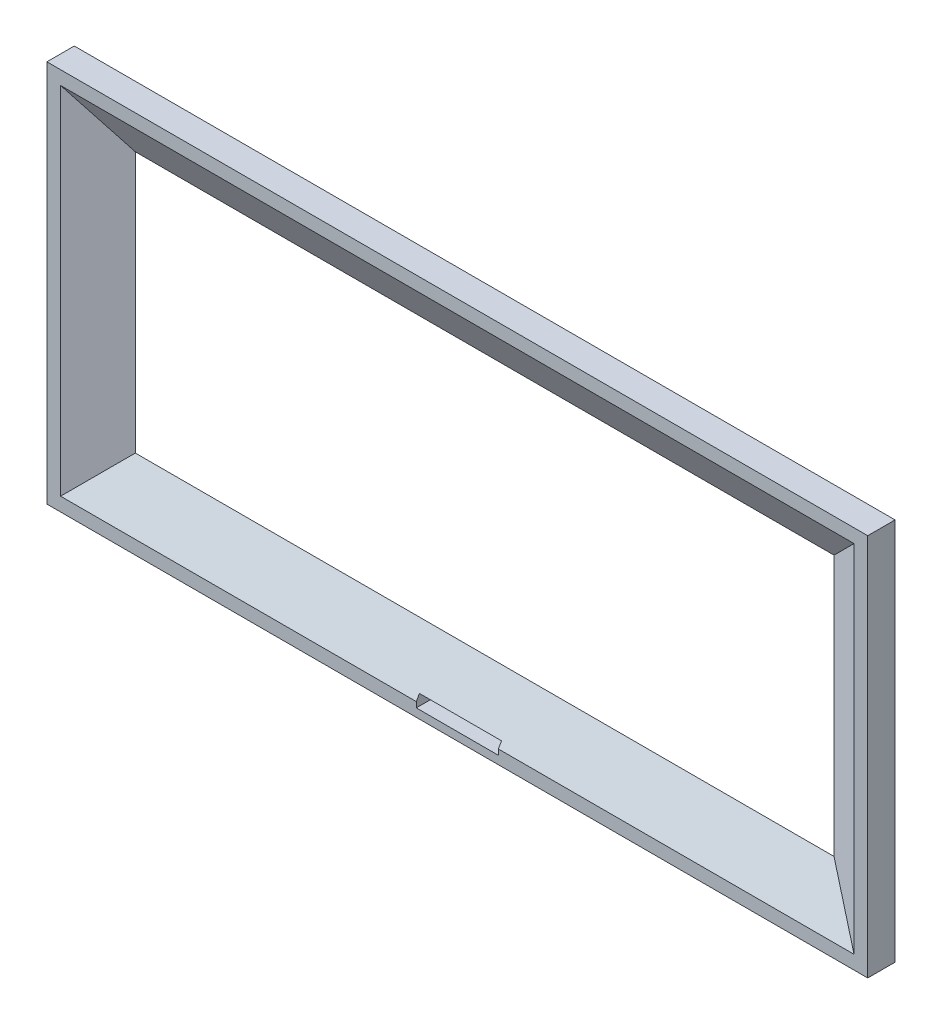
ISO-10303-21;
HEADER;
FILE_DESCRIPTION(('STEP AP214'),'2;1');
FILE_NAME('part.step','',(''),(''),'','','');
FILE_SCHEMA(('AUTOMOTIVE_DESIGN { 1 0 10303 214 1 1 1 1 }'));
ENDSEC;
DATA;
#1=APPLICATION_CONTEXT('core data for automotive mechanical design processes');
#2=APPLICATION_PROTOCOL_DEFINITION('international standard','automotive_design',2000,#1);
#3=PRODUCT_CONTEXT('',#1,'mechanical');
#4=PRODUCT('Part','Part','',(#3));
#5=PRODUCT_RELATED_PRODUCT_CATEGORY('part','',(#4));
#6=PRODUCT_DEFINITION_FORMATION('','',#4);
#7=PRODUCT_DEFINITION_CONTEXT('part definition',#1,'design');
#8=PRODUCT_DEFINITION('design','',#6,#7);
#9=PRODUCT_DEFINITION_SHAPE('','',#8);
#10=(LENGTH_UNIT() NAMED_UNIT(*) SI_UNIT(.MILLI.,.METRE.));
#11=(NAMED_UNIT(*) PLANE_ANGLE_UNIT() SI_UNIT($,.RADIAN.));
#12=(NAMED_UNIT(*) SI_UNIT($,.STERADIAN.) SOLID_ANGLE_UNIT());
#13=UNCERTAINTY_MEASURE_WITH_UNIT(LENGTH_MEASURE(1.E-05),#10,'distance_accuracy_value','');
#14=(GEOMETRIC_REPRESENTATION_CONTEXT(3) GLOBAL_UNCERTAINTY_ASSIGNED_CONTEXT((#13)) GLOBAL_UNIT_ASSIGNED_CONTEXT((#10,
#11,#12)) REPRESENTATION_CONTEXT('',''));
#15=CARTESIAN_POINT('',(0.,0.,0.));
#16=DIRECTION('',(0.,0.,1.));
#17=DIRECTION('',(1.,0.,0.));
#18=AXIS2_PLACEMENT_3D('',#15,#16,#17);
#19=CARTESIAN_POINT('',(0.,0.,10.));
#20=DIRECTION('',(0.,0.,-1.));
#21=DIRECTION('',(-1.,0.,0.));
#22=AXIS2_PLACEMENT_3D('',#19,#20,#21);
#23=PLANE('',#22);
#24=DIRECTION('',(1.,0.,0.));
#25=VECTOR('',#24,1.);
#26=CARTESIAN_POINT('',(140.,-22.,10.));
#27=LINE('',#26,#25);
#28=CARTESIAN_POINT('',(110.,-22.0000000000001,10.));
#29=VERTEX_POINT('',#28);
#30=CARTESIAN_POINT('',(140.,-22.,10.));
#31=VERTEX_POINT('',#30);
#32=EDGE_CURVE('E139',#29,#31,#27,.T.);
#33=ORIENTED_EDGE('',*,*,#32,.F.);
#34=DIRECTION('',(0.,-1.,0.));
#35=VECTOR('',#34,1.);
#36=CARTESIAN_POINT('',(110.,-22.0000000000001,10.));
#37=LINE('',#36,#35);
#38=CARTESIAN_POINT('',(110.,-20.0000000000001,10.));
#39=VERTEX_POINT('',#38);
#40=EDGE_CURVE('E146',#39,#29,#37,.T.);
#41=ORIENTED_EDGE('',*,*,#40,.F.);
#42=DIRECTION('',(-1.,0.,0.));
#43=VECTOR('',#42,1.);
#44=CARTESIAN_POINT('',(0.,-20.0000000000001,10.));
#45=LINE('',#44,#43);
#46=CARTESIAN_POINT('',(-20.0000000000001,-20.0000000000001,10.));
#47=VERTEX_POINT('',#46);
#48=EDGE_CURVE('E236',#39,#47,#45,.T.);
#49=ORIENTED_EDGE('',*,*,#48,.T.);
#50=DIRECTION('',(0.,1.,0.));
#51=VECTOR('',#50,1.);
#52=CARTESIAN_POINT('',(-20.0000000000001,90.,10.));
#53=LINE('',#52,#51);
#54=CARTESIAN_POINT('',(-20.0000000000001,110.,10.));
#55=VERTEX_POINT('',#54);
#56=EDGE_CURVE('E240',#47,#55,#53,.T.);
#57=ORIENTED_EDGE('',*,*,#56,.T.);
#58=DIRECTION('',(1.,0.,0.));
#59=VECTOR('',#58,1.);
#60=CARTESIAN_POINT('',(250.,110.,10.));
#61=LINE('',#60,#59);
#62=CARTESIAN_POINT('',(270.,110.,10.));
#63=VERTEX_POINT('',#62);
#64=EDGE_CURVE('E243',#55,#63,#61,.T.);
#65=ORIENTED_EDGE('',*,*,#64,.T.);
#66=DIRECTION('',(0.,-1.,0.));
#67=VECTOR('',#66,1.);
#68=CARTESIAN_POINT('',(270.,0.,10.));
#69=LINE('',#68,#67);
#70=CARTESIAN_POINT('',(270.,-20.0000000000001,10.));
#71=VERTEX_POINT('',#70);
#72=EDGE_CURVE('E246',#63,#71,#69,.T.);
#73=ORIENTED_EDGE('',*,*,#72,.T.);
#74=CARTESIAN_POINT('',(140.,-20.0000000000001,10.));
#75=VERTEX_POINT('',#74);
#76=EDGE_CURVE('E237',#71,#75,#45,.T.);
#77=ORIENTED_EDGE('',*,*,#76,.T.);
#78=DIRECTION('',(0.,1.,0.));
#79=VECTOR('',#78,1.);
#80=CARTESIAN_POINT('',(140.,-22.,10.));
#81=LINE('',#80,#79);
#82=EDGE_CURVE('E64',#31,#75,#81,.T.);
#83=ORIENTED_EDGE('',*,*,#82,.F.);
#84=EDGE_LOOP('',(#33,#41,#49,#57,#65,#73,#77,#83));
#85=FACE_BOUND('',#84,.T.);
#86=DIRECTION('',(0.,-1.,0.));
#87=VECTOR('',#86,1.);
#88=CARTESIAN_POINT('',(-25.,-25.,10.));
#89=LINE('',#88,#87);
#90=CARTESIAN_POINT('',(-25.,115.,10.));
#91=VERTEX_POINT('',#90);
#92=CARTESIAN_POINT('',(-25.,-25.,10.));
#93=VERTEX_POINT('',#92);
#94=EDGE_CURVE('E180',#91,#93,#89,.T.);
#95=ORIENTED_EDGE('',*,*,#94,.T.);
#96=DIRECTION('',(1.,0.,0.));
#97=VECTOR('',#96,1.);
#98=CARTESIAN_POINT('',(-25.,-25.,10.));
#99=LINE('',#98,#97);
#100=CARTESIAN_POINT('',(275.,-25.,10.));
#101=VERTEX_POINT('',#100);
#102=EDGE_CURVE('E184',#93,#101,#99,.T.);
#103=ORIENTED_EDGE('',*,*,#102,.T.);
#104=DIRECTION('',(0.,1.,0.));
#105=VECTOR('',#104,1.);
#106=CARTESIAN_POINT('',(275.,-25.,10.));
#107=LINE('',#106,#105);
#108=CARTESIAN_POINT('',(275.,115.,10.));
#109=VERTEX_POINT('',#108);
#110=EDGE_CURVE('E188',#101,#109,#107,.T.);
#111=ORIENTED_EDGE('',*,*,#110,.T.);
#112=DIRECTION('',(-1.,0.,0.));
#113=VECTOR('',#112,1.);
#114=CARTESIAN_POINT('',(-25.,115.,10.));
#115=LINE('',#114,#113);
#116=EDGE_CURVE('E191',#109,#91,#115,.T.);
#117=ORIENTED_EDGE('',*,*,#116,.T.);
#118=EDGE_LOOP('',(#95,#103,#111,#117));
#119=FACE_BOUND('',#118,.T.);
#120=ADVANCED_FACE('F41',(#85,#119),#23,.F.);
#121=CARTESIAN_POINT('',(0.,0.,0.));
#122=DIRECTION('',(0.,0.,-1.));
#123=DIRECTION('',(-1.,0.,0.));
#124=AXIS2_PLACEMENT_3D('',#121,#122,#123);
#125=PLANE('',#124);
#126=DIRECTION('',(0.,1.,0.));
#127=VECTOR('',#126,1.);
#128=CARTESIAN_POINT('',(110.,0.,0.));
#129=LINE('',#128,#127);
#130=CARTESIAN_POINT('',(110.,-22.0000000000001,0.));
#131=VERTEX_POINT('',#130);
#132=CARTESIAN_POINT('',(110.,-18.0000000000001,0.));
#133=VERTEX_POINT('',#132);
#134=EDGE_CURVE('E176',#131,#133,#129,.T.);
#135=ORIENTED_EDGE('',*,*,#134,.F.);
#136=DIRECTION('',(-1.,0.,0.));
#137=VECTOR('',#136,1.);
#138=CARTESIAN_POINT('',(0.,-22.0000000000001,0.));
#139=LINE('',#138,#137);
#140=CARTESIAN_POINT('',(140.,-22.,0.));
#141=VERTEX_POINT('',#140);
#142=EDGE_CURVE('E11',#141,#131,#139,.T.);
#143=ORIENTED_EDGE('',*,*,#142,.F.);
#144=DIRECTION('',(0.,-1.,0.));
#145=VECTOR('',#144,1.);
#146=CARTESIAN_POINT('',(140.,0.,0.));
#147=LINE('',#146,#145);
#148=CARTESIAN_POINT('',(140.,-18.,0.));
#149=VERTEX_POINT('',#148);
#150=EDGE_CURVE('E164',#149,#141,#147,.T.);
#151=ORIENTED_EDGE('',*,*,#150,.F.);
#152=DIRECTION('',(1.,0.,0.));
#153=VECTOR('',#152,1.);
#154=CARTESIAN_POINT('',(0.,-18.0000000000001,0.));
#155=LINE('',#154,#153);
#156=EDGE_CURVE('E173',#133,#149,#155,.T.);
#157=ORIENTED_EDGE('',*,*,#156,.F.);
#158=EDGE_LOOP('',(#135,#143,#151,#157));
#159=FACE_BOUND('',#158,.T.);
#160=DIRECTION('',(1.,0.,0.));
#161=VECTOR('',#160,1.);
#162=CARTESIAN_POINT('',(0.,-2.67949192431157,0.));
#163=LINE('',#162,#161);
#164=CARTESIAN_POINT('',(-2.67949192431157,-2.67949192431157,0.));
#165=VERTEX_POINT('',#164);
#166=CARTESIAN_POINT('',(252.679491924312,-2.67949192431157,0.));
#167=VERTEX_POINT('',#166);
#168=EDGE_CURVE('E223',#165,#167,#163,.T.);
#169=ORIENTED_EDGE('',*,*,#168,.T.);
#170=DIRECTION('',(0.,1.,0.));
#171=VECTOR('',#170,1.);
#172=CARTESIAN_POINT('',(252.679491924312,0.,0.));
#173=LINE('',#172,#171);
#174=CARTESIAN_POINT('',(252.679491924311,92.6794919243115,0.));
#175=VERTEX_POINT('',#174);
#176=EDGE_CURVE('E232',#167,#175,#173,.T.);
#177=ORIENTED_EDGE('',*,*,#176,.T.);
#178=DIRECTION('',(-1.,0.,0.));
#179=VECTOR('',#178,1.);
#180=CARTESIAN_POINT('',(0.,92.6794919243115,0.));
#181=LINE('',#180,#179);
#182=CARTESIAN_POINT('',(-2.67949192431157,92.6794919243115,0.));
#183=VERTEX_POINT('',#182);
#184=EDGE_CURVE('E229',#175,#183,#181,.T.);
#185=ORIENTED_EDGE('',*,*,#184,.T.);
#186=DIRECTION('',(0.,-1.,0.));
#187=VECTOR('',#186,1.);
#188=CARTESIAN_POINT('',(-2.67949192431157,0.,0.));
#189=LINE('',#188,#187);
#190=EDGE_CURVE('E226',#183,#165,#189,.T.);
#191=ORIENTED_EDGE('',*,*,#190,.T.);
#192=EDGE_LOOP('',(#169,#177,#185,#191));
#193=FACE_BOUND('',#192,.T.);
#194=DIRECTION('',(0.,-1.,0.));
#195=VECTOR('',#194,1.);
#196=CARTESIAN_POINT('',(-25.,-25.,0.));
#197=LINE('',#196,#195);
#198=CARTESIAN_POINT('',(-25.,115.,0.));
#199=VERTEX_POINT('',#198);
#200=CARTESIAN_POINT('',(-25.,-25.,0.));
#201=VERTEX_POINT('',#200);
#202=EDGE_CURVE('E195',#199,#201,#197,.T.);
#203=ORIENTED_EDGE('',*,*,#202,.F.);
#204=DIRECTION('',(-1.,0.,0.));
#205=VECTOR('',#204,1.);
#206=CARTESIAN_POINT('',(-25.,115.,0.));
#207=LINE('',#206,#205);
#208=CARTESIAN_POINT('',(275.,115.,0.));
#209=VERTEX_POINT('',#208);
#210=EDGE_CURVE('E185',#209,#199,#207,.T.);
#211=ORIENTED_EDGE('',*,*,#210,.F.);
#212=DIRECTION('',(0.,1.,0.));
#213=VECTOR('',#212,1.);
#214=CARTESIAN_POINT('',(275.,-25.,0.));
#215=LINE('',#214,#213);
#216=CARTESIAN_POINT('',(275.,-25.,0.));
#217=VERTEX_POINT('',#216);
#218=EDGE_CURVE('E203',#217,#209,#215,.T.);
#219=ORIENTED_EDGE('',*,*,#218,.F.);
#220=DIRECTION('',(1.,0.,0.));
#221=VECTOR('',#220,1.);
#222=CARTESIAN_POINT('',(-25.,-25.,0.));
#223=LINE('',#222,#221);
#224=EDGE_CURVE('E199',#201,#217,#223,.T.);
#225=ORIENTED_EDGE('',*,*,#224,.F.);
#226=EDGE_LOOP('',(#203,#211,#219,#225));
#227=FACE_BOUND('',#226,.T.);
#228=ADVANCED_FACE('F282',(#159,#193,#227),#125,.T.);
#229=CARTESIAN_POINT('',(-25.,-25.,10.));
#230=DIRECTION('',(1.,0.,0.));
#231=DIRECTION('',(0.,0.,-1.));
#232=AXIS2_PLACEMENT_3D('',#229,#230,#231);
#233=PLANE('',#232);
#234=ORIENTED_EDGE('',*,*,#202,.T.);
#235=DIRECTION('',(0.,0.,-1.));
#236=VECTOR('',#235,1.);
#237=CARTESIAN_POINT('',(-25.,-25.,10.));
#238=LINE('',#237,#236);
#239=EDGE_CURVE('E219',#93,#201,#238,.T.);
#240=ORIENTED_EDGE('',*,*,#239,.F.);
#241=ORIENTED_EDGE('',*,*,#94,.F.);
#242=DIRECTION('',(0.,0.,-1.));
#243=VECTOR('',#242,1.);
#244=CARTESIAN_POINT('',(-25.,115.,10.));
#245=LINE('',#244,#243);
#246=EDGE_CURVE('E194',#91,#199,#245,.T.);
#247=ORIENTED_EDGE('',*,*,#246,.T.);
#248=EDGE_LOOP('',(#234,#240,#241,#247));
#249=FACE_BOUND('',#248,.T.);
#250=ADVANCED_FACE('F301',(#249),#233,.F.);
#251=CARTESIAN_POINT('',(-25.,-25.,10.));
#252=DIRECTION('',(0.,1.,0.));
#253=DIRECTION('',(0.,0.,1.));
#254=AXIS2_PLACEMENT_3D('',#251,#252,#253);
#255=PLANE('',#254);
#256=ORIENTED_EDGE('',*,*,#224,.T.);
#257=DIRECTION('',(0.,0.,-1.));
#258=VECTOR('',#257,1.);
#259=CARTESIAN_POINT('',(275.,-25.,10.));
#260=LINE('',#259,#258);
#261=EDGE_CURVE('E215',#101,#217,#260,.T.);
#262=ORIENTED_EDGE('',*,*,#261,.F.);
#263=ORIENTED_EDGE('',*,*,#102,.F.);
#264=ORIENTED_EDGE('',*,*,#239,.T.);
#265=EDGE_LOOP('',(#256,#262,#263,#264));
#266=FACE_BOUND('',#265,.T.);
#267=ADVANCED_FACE('F307',(#266),#255,.F.);
#268=CARTESIAN_POINT('',(275.,-25.,10.));
#269=DIRECTION('',(-1.,0.,0.));
#270=DIRECTION('',(0.,0.,1.));
#271=AXIS2_PLACEMENT_3D('',#268,#269,#270);
#272=PLANE('',#271);
#273=ORIENTED_EDGE('',*,*,#218,.T.);
#274=DIRECTION('',(0.,0.,-1.));
#275=VECTOR('',#274,1.);
#276=CARTESIAN_POINT('',(275.,115.,10.));
#277=LINE('',#276,#275);
#278=EDGE_CURVE('E211',#109,#209,#277,.T.);
#279=ORIENTED_EDGE('',*,*,#278,.F.);
#280=ORIENTED_EDGE('',*,*,#110,.F.);
#281=ORIENTED_EDGE('',*,*,#261,.T.);
#282=EDGE_LOOP('',(#273,#279,#280,#281));
#283=FACE_BOUND('',#282,.T.);
#284=ADVANCED_FACE('F316',(#283),#272,.F.);
#285=CARTESIAN_POINT('',(-25.,115.,10.));
#286=DIRECTION('',(0.,-1.,0.));
#287=DIRECTION('',(0.,0.,-1.));
#288=AXIS2_PLACEMENT_3D('',#285,#286,#287);
#289=PLANE('',#288);
#290=ORIENTED_EDGE('',*,*,#210,.T.);
#291=ORIENTED_EDGE('',*,*,#246,.F.);
#292=ORIENTED_EDGE('',*,*,#116,.F.);
#293=ORIENTED_EDGE('',*,*,#278,.T.);
#294=EDGE_LOOP('',(#290,#291,#292,#293));
#295=FACE_BOUND('',#294,.T.);
#296=ADVANCED_FACE('F313',(#295),#289,.F.);
#297=CARTESIAN_POINT('',(0.,0.,-1.54700538379273));
#298=DIRECTION('',(0.500000000000006,0.,0.866025403784435));
#299=DIRECTION('',(0.,1.,0.));
#300=AXIS2_PLACEMENT_3D('',#297,#298,#299);
#301=PLANE('',#300);
#302=DIRECTION('',(0.654653670707976,-0.654653670707976,-0.377964473009232));
#303=VECTOR('',#302,1.);
#304=CARTESIAN_POINT('',(38.5714285714284,51.4285714285716,-23.8162300525357));
#305=LINE('',#304,#303);
#306=EDGE_CURVE('E256',#55,#183,#305,.T.);
#307=ORIENTED_EDGE('',*,*,#306,.F.);
#308=ORIENTED_EDGE('',*,*,#56,.F.);
#309=DIRECTION('',(0.654653670707976,0.654653670707976,-0.377964473009232));
#310=VECTOR('',#309,1.);
#311=CARTESIAN_POINT('',(0.,0.,-1.54700538379273));
#312=LINE('',#311,#310);
#313=EDGE_CURVE('E200',#165,#47,#312,.F.);
#314=ORIENTED_EDGE('',*,*,#313,.F.);
#315=ORIENTED_EDGE('',*,*,#190,.F.);
#316=EDGE_LOOP('',(#307,#308,#314,#315));
#317=FACE_BOUND('',#316,.T.);
#318=ADVANCED_FACE('F44',(#317),#301,.T.);
#319=CARTESIAN_POINT('',(0.,0.,-1.54700538379273));
#320=DIRECTION('',(0.,0.500000000000006,0.866025403784435));
#321=DIRECTION('',(-1.,0.,0.));
#322=AXIS2_PLACEMENT_3D('',#319,#320,#321);
#323=PLANE('',#322);
#324=DIRECTION('',(0.,-0.866025403784435,0.500000000000006));
#325=VECTOR('',#324,1.);
#326=CARTESIAN_POINT('',(110.,0.,-1.54700538379273));
#327=LINE('',#326,#325);
#328=CARTESIAN_POINT('',(110.,-18.0000000000001,8.84529946162072));
#329=VERTEX_POINT('',#328);
#330=EDGE_CURVE('E51',#329,#39,#327,.T.);
#331=ORIENTED_EDGE('',*,*,#330,.F.);
#332=DIRECTION('',(-1.,0.,0.));
#333=VECTOR('',#332,1.);
#334=CARTESIAN_POINT('',(0.,-18.0000000000001,8.84529946162072));
#335=LINE('',#334,#333);
#336=CARTESIAN_POINT('',(140.,-18.,8.84529946162072));
#337=VERTEX_POINT('',#336);
#338=EDGE_CURVE('E265',#337,#329,#335,.T.);
#339=ORIENTED_EDGE('',*,*,#338,.F.);
#340=DIRECTION('',(0.,0.866025403784435,-0.500000000000006));
#341=VECTOR('',#340,1.);
#342=CARTESIAN_POINT('',(140.,0.,-1.54700538379273));
#343=LINE('',#342,#341);
#344=EDGE_CURVE('E250',#75,#337,#343,.T.);
#345=ORIENTED_EDGE('',*,*,#344,.F.);
#346=ORIENTED_EDGE('',*,*,#76,.F.);
#347=DIRECTION('',(0.654653670707976,-0.654653670707976,0.377964473009232));
#348=VECTOR('',#347,1.);
#349=CARTESIAN_POINT('',(142.857142857143,107.142857142857,-63.4059627969676));
#350=LINE('',#349,#348);
#351=EDGE_CURVE('E253',#167,#71,#350,.T.);
#352=ORIENTED_EDGE('',*,*,#351,.F.);
#353=ORIENTED_EDGE('',*,*,#168,.F.);
#354=ORIENTED_EDGE('',*,*,#313,.T.);
#355=ORIENTED_EDGE('',*,*,#48,.F.);
#356=EDGE_LOOP('',(#331,#339,#345,#346,#352,#353,#354,#355));
#357=FACE_BOUND('',#356,.T.);
#358=ADVANCED_FACE('F277',(#357),#323,.T.);
#359=CARTESIAN_POINT('',(0.,90.,-1.54700538379273));
#360=DIRECTION('',(0.,-0.500000000000006,0.866025403784435));
#361=DIRECTION('',(1.,0.,0.));
#362=AXIS2_PLACEMENT_3D('',#359,#360,#361);
#363=PLANE('',#362);
#364=ORIENTED_EDGE('',*,*,#306,.T.);
#365=ORIENTED_EDGE('',*,*,#184,.F.);
#366=DIRECTION('',(-0.654653670707976,-0.654653670707976,-0.377964473009232));
#367=VECTOR('',#366,1.);
#368=CARTESIAN_POINT('',(142.857142857143,-17.1428571428567,-63.4059627969676));
#369=LINE('',#368,#367);
#370=EDGE_CURVE('E179',#63,#175,#369,.T.);
#371=ORIENTED_EDGE('',*,*,#370,.F.);
#372=ORIENTED_EDGE('',*,*,#64,.F.);
#373=EDGE_LOOP('',(#364,#365,#371,#372));
#374=FACE_BOUND('',#373,.T.);
#375=ADVANCED_FACE('F286',(#374),#363,.T.);
#376=CARTESIAN_POINT('',(250.,0.,-1.54700538379273));
#377=DIRECTION('',(-0.500000000000006,0.,0.866025403784435));
#378=DIRECTION('',(0.,-1.,0.));
#379=AXIS2_PLACEMENT_3D('',#376,#377,#378);
#380=PLANE('',#379);
#381=ORIENTED_EDGE('',*,*,#351,.T.);
#382=ORIENTED_EDGE('',*,*,#72,.F.);
#383=ORIENTED_EDGE('',*,*,#370,.T.);
#384=ORIENTED_EDGE('',*,*,#176,.F.);
#385=EDGE_LOOP('',(#381,#382,#383,#384));
#386=FACE_BOUND('',#385,.T.);
#387=ADVANCED_FACE('F290',(#386),#380,.T.);
#388=CARTESIAN_POINT('',(110.,-22.0000000000001,-34.));
#389=DIRECTION('',(-1.,0.,0.));
#390=DIRECTION('',(0.,0.,1.));
#391=AXIS2_PLACEMENT_3D('',#388,#389,#390);
#392=PLANE('',#391);
#393=ORIENTED_EDGE('',*,*,#134,.T.);
#394=DIRECTION('',(0.,0.,1.));
#395=VECTOR('',#394,1.);
#396=CARTESIAN_POINT('',(110.,-18.0000000000001,-34.));
#397=LINE('',#396,#395);
#398=EDGE_CURVE('E161',#133,#329,#397,.T.);
#399=ORIENTED_EDGE('',*,*,#398,.T.);
#400=ORIENTED_EDGE('',*,*,#330,.T.);
#401=ORIENTED_EDGE('',*,*,#40,.T.);
#402=DIRECTION('',(0.,0.,1.));
#403=VECTOR('',#402,1.);
#404=CARTESIAN_POINT('',(110.,-22.0000000000001,-34.));
#405=LINE('',#404,#403);
#406=EDGE_CURVE('E135',#131,#29,#405,.T.);
#407=ORIENTED_EDGE('',*,*,#406,.F.);
#408=EDGE_LOOP('',(#393,#399,#400,#401,#407));
#409=FACE_BOUND('',#408,.T.);
#410=ADVANCED_FACE('F147',(#409),#392,.F.);
#411=CARTESIAN_POINT('',(140.,-18.,-34.));
#412=DIRECTION('',(0.,1.,0.));
#413=DIRECTION('',(-1.,0.,0.));
#414=AXIS2_PLACEMENT_3D('',#411,#412,#413);
#415=PLANE('',#414);
#416=ORIENTED_EDGE('',*,*,#156,.T.);
#417=DIRECTION('',(0.,0.,1.));
#418=VECTOR('',#417,1.);
#419=CARTESIAN_POINT('',(140.,-18.,-34.));
#420=LINE('',#419,#418);
#421=EDGE_CURVE('E165',#149,#337,#420,.T.);
#422=ORIENTED_EDGE('',*,*,#421,.T.);
#423=ORIENTED_EDGE('',*,*,#338,.T.);
#424=ORIENTED_EDGE('',*,*,#398,.F.);
#425=EDGE_LOOP('',(#416,#422,#423,#424));
#426=FACE_BOUND('',#425,.T.);
#427=ADVANCED_FACE('F296',(#426),#415,.F.);
#428=CARTESIAN_POINT('',(140.,-22.,-34.));
#429=DIRECTION('',(1.,0.,0.));
#430=DIRECTION('',(0.,0.,-1.));
#431=AXIS2_PLACEMENT_3D('',#428,#429,#430);
#432=PLANE('',#431);
#433=ORIENTED_EDGE('',*,*,#150,.T.);
#434=DIRECTION('',(0.,0.,1.));
#435=VECTOR('',#434,1.);
#436=CARTESIAN_POINT('',(140.,-22.,-34.));
#437=LINE('',#436,#435);
#438=EDGE_CURVE('E57',#141,#31,#437,.T.);
#439=ORIENTED_EDGE('',*,*,#438,.T.);
#440=ORIENTED_EDGE('',*,*,#82,.T.);
#441=ORIENTED_EDGE('',*,*,#344,.T.);
#442=ORIENTED_EDGE('',*,*,#421,.F.);
#443=EDGE_LOOP('',(#433,#439,#440,#441,#442));
#444=FACE_BOUND('',#443,.T.);
#445=ADVANCED_FACE('F293',(#444),#432,.F.);
#446=CARTESIAN_POINT('',(140.,-22.,-34.));
#447=DIRECTION('',(0.,-1.,0.));
#448=DIRECTION('',(1.,0.,0.));
#449=AXIS2_PLACEMENT_3D('',#446,#447,#448);
#450=PLANE('',#449);
#451=ORIENTED_EDGE('',*,*,#142,.T.);
#452=ORIENTED_EDGE('',*,*,#406,.T.);
#453=ORIENTED_EDGE('',*,*,#32,.T.);
#454=ORIENTED_EDGE('',*,*,#438,.F.);
#455=EDGE_LOOP('',(#451,#452,#453,#454));
#456=FACE_BOUND('',#455,.T.);
#457=ADVANCED_FACE('F137',(#456),#450,.F.);
#458=CLOSED_SHELL('',(#120,#228,#250,#267,#284,#296,#318,#358,#375,#387,#410,#427,#445,#457));
#459=MANIFOLD_SOLID_BREP('B2',#458);
#460=ADVANCED_BREP_SHAPE_REPRESENTATION('',(#18,#459),#14);
#461=SHAPE_DEFINITION_REPRESENTATION(#9,#460);
ENDSEC;
END-ISO-10303-21;
